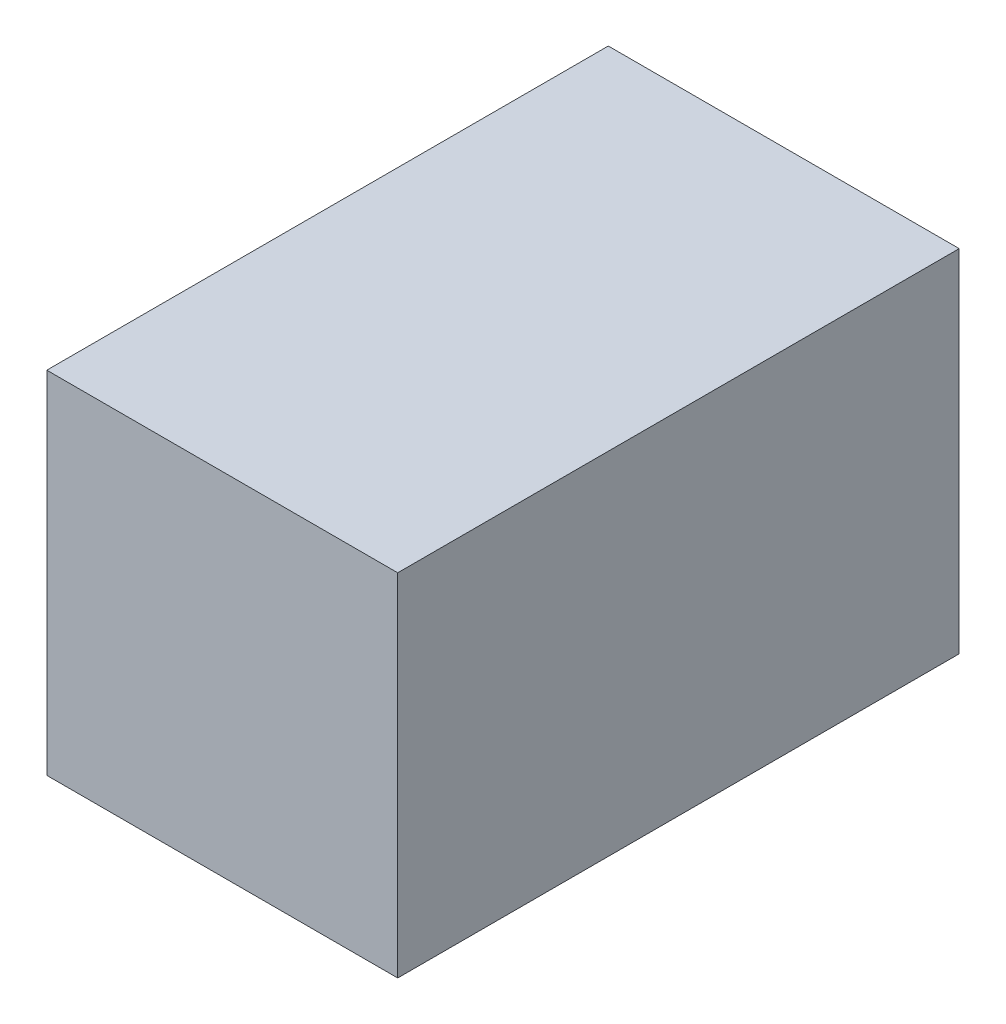
ISO-10303-21;
HEADER;
FILE_DESCRIPTION(('STEP AP214'),'2;1');
FILE_NAME('part.step','',(''),(''),'','','');
FILE_SCHEMA(('AUTOMOTIVE_DESIGN { 1 0 10303 214 1 1 1 1 }'));
ENDSEC;
DATA;
#1=APPLICATION_CONTEXT('core data for automotive mechanical design processes');
#2=APPLICATION_PROTOCOL_DEFINITION('international standard','automotive_design',2000,#1);
#3=PRODUCT_CONTEXT('',#1,'mechanical');
#4=PRODUCT('Part','Part','',(#3));
#5=PRODUCT_RELATED_PRODUCT_CATEGORY('part','',(#4));
#6=PRODUCT_DEFINITION_FORMATION('','',#4);
#7=PRODUCT_DEFINITION_CONTEXT('part definition',#1,'design');
#8=PRODUCT_DEFINITION('design','',#6,#7);
#9=PRODUCT_DEFINITION_SHAPE('','',#8);
#10=(LENGTH_UNIT() NAMED_UNIT(*) SI_UNIT(.MILLI.,.METRE.));
#11=(NAMED_UNIT(*) PLANE_ANGLE_UNIT() SI_UNIT($,.RADIAN.));
#12=(NAMED_UNIT(*) SI_UNIT($,.STERADIAN.) SOLID_ANGLE_UNIT());
#13=UNCERTAINTY_MEASURE_WITH_UNIT(LENGTH_MEASURE(1.E-05),#10,'distance_accuracy_value','');
#14=(GEOMETRIC_REPRESENTATION_CONTEXT(3) GLOBAL_UNCERTAINTY_ASSIGNED_CONTEXT((#13)) GLOBAL_UNIT_ASSIGNED_CONTEXT((#10,
#11,#12)) REPRESENTATION_CONTEXT('',''));
#15=CARTESIAN_POINT('',(0.,0.,0.));
#16=DIRECTION('',(0.,0.,1.));
#17=DIRECTION('',(1.,0.,0.));
#18=AXIS2_PLACEMENT_3D('',#15,#16,#17);
#19=CARTESIAN_POINT('',(0.5,1.,-0.8));
#20=DIRECTION('',(-1.,0.,0.));
#21=DIRECTION('',(0.,0.,1.));
#22=AXIS2_PLACEMENT_3D('',#19,#20,#21);
#23=PLANE('',#22);
#24=DIRECTION('',(0.,0.,-1.));
#25=VECTOR('',#24,1.);
#26=CARTESIAN_POINT('',(0.5,0.,-0.8));
#27=LINE('',#26,#25);
#28=CARTESIAN_POINT('',(0.5,0.,0.8));
#29=VERTEX_POINT('',#28);
#30=CARTESIAN_POINT('',(0.5,0.,-0.8));
#31=VERTEX_POINT('',#30);
#32=EDGE_CURVE('E98',#29,#31,#27,.T.);
#33=ORIENTED_EDGE('',*,*,#32,.T.);
#34=DIRECTION('',(0.,-1.,0.));
#35=VECTOR('',#34,1.);
#36=CARTESIAN_POINT('',(0.5,1.,-0.8));
#37=LINE('',#36,#35);
#38=CARTESIAN_POINT('',(0.5,1.,-0.8));
#39=VERTEX_POINT('',#38);
#40=EDGE_CURVE('E11',#39,#31,#37,.T.);
#41=ORIENTED_EDGE('',*,*,#40,.F.);
#42=DIRECTION('',(0.,0.,-1.));
#43=VECTOR('',#42,1.);
#44=CARTESIAN_POINT('',(0.5,1.,-0.8));
#45=LINE('',#44,#43);
#46=CARTESIAN_POINT('',(0.5,1.,0.8));
#47=VERTEX_POINT('',#46);
#48=EDGE_CURVE('E86',#47,#39,#45,.T.);
#49=ORIENTED_EDGE('',*,*,#48,.F.);
#50=DIRECTION('',(0.,-1.,0.));
#51=VECTOR('',#50,1.);
#52=CARTESIAN_POINT('',(0.5,1.,0.8));
#53=LINE('',#52,#51);
#54=EDGE_CURVE('E94',#47,#29,#53,.T.);
#55=ORIENTED_EDGE('',*,*,#54,.T.);
#56=EDGE_LOOP('',(#33,#41,#49,#55));
#57=FACE_BOUND('',#56,.T.);
#58=ADVANCED_FACE('F35',(#57),#23,.F.);
#59=CARTESIAN_POINT('',(-0.5,1.,-0.8));
#60=DIRECTION('',(0.,0.,1.));
#61=DIRECTION('',(1.,0.,0.));
#62=AXIS2_PLACEMENT_3D('',#59,#60,#61);
#63=PLANE('',#62);
#64=DIRECTION('',(-1.,0.,0.));
#65=VECTOR('',#64,1.);
#66=CARTESIAN_POINT('',(-0.5,0.,-0.8));
#67=LINE('',#66,#65);
#68=CARTESIAN_POINT('',(-0.5,0.,-0.8));
#69=VERTEX_POINT('',#68);
#70=EDGE_CURVE('E90',#31,#69,#67,.T.);
#71=ORIENTED_EDGE('',*,*,#70,.T.);
#72=DIRECTION('',(0.,-1.,0.));
#73=VECTOR('',#72,1.);
#74=CARTESIAN_POINT('',(-0.5,1.,-0.8));
#75=LINE('',#74,#73);
#76=CARTESIAN_POINT('',(-0.5,1.,-0.8));
#77=VERTEX_POINT('',#76);
#78=EDGE_CURVE('E43',#77,#69,#75,.T.);
#79=ORIENTED_EDGE('',*,*,#78,.F.);
#80=DIRECTION('',(-1.,0.,0.));
#81=VECTOR('',#80,1.);
#82=CARTESIAN_POINT('',(-0.5,1.,-0.8));
#83=LINE('',#82,#81);
#84=EDGE_CURVE('E81',#39,#77,#83,.T.);
#85=ORIENTED_EDGE('',*,*,#84,.F.);
#86=ORIENTED_EDGE('',*,*,#40,.T.);
#87=EDGE_LOOP('',(#71,#79,#85,#86));
#88=FACE_BOUND('',#87,.T.);
#89=ADVANCED_FACE('F89',(#88),#63,.F.);
#90=CARTESIAN_POINT('',(-0.5,1.,-0.8));
#91=DIRECTION('',(1.,0.,0.));
#92=DIRECTION('',(0.,0.,-1.));
#93=AXIS2_PLACEMENT_3D('',#90,#91,#92);
#94=PLANE('',#93);
#95=DIRECTION('',(0.,0.,1.));
#96=VECTOR('',#95,1.);
#97=CARTESIAN_POINT('',(-0.5,0.,-0.8));
#98=LINE('',#97,#96);
#99=CARTESIAN_POINT('',(-0.5,0.,0.8));
#100=VERTEX_POINT('',#99);
#101=EDGE_CURVE('E68',#69,#100,#98,.T.);
#102=ORIENTED_EDGE('',*,*,#101,.T.);
#103=DIRECTION('',(0.,-1.,0.));
#104=VECTOR('',#103,1.);
#105=CARTESIAN_POINT('',(-0.5,1.,0.8));
#106=LINE('',#105,#104);
#107=CARTESIAN_POINT('',(-0.5,1.,0.8));
#108=VERTEX_POINT('',#107);
#109=EDGE_CURVE('E91',#108,#100,#106,.T.);
#110=ORIENTED_EDGE('',*,*,#109,.F.);
#111=DIRECTION('',(0.,0.,1.));
#112=VECTOR('',#111,1.);
#113=CARTESIAN_POINT('',(-0.5,1.,-0.8));
#114=LINE('',#113,#112);
#115=EDGE_CURVE('E84',#77,#108,#114,.T.);
#116=ORIENTED_EDGE('',*,*,#115,.F.);
#117=ORIENTED_EDGE('',*,*,#78,.T.);
#118=EDGE_LOOP('',(#102,#110,#116,#117));
#119=FACE_BOUND('',#118,.T.);
#120=ADVANCED_FACE('F92',(#119),#94,.F.);
#121=CARTESIAN_POINT('',(-0.5,1.,0.8));
#122=DIRECTION('',(0.,0.,-1.));
#123=DIRECTION('',(-1.,0.,0.));
#124=AXIS2_PLACEMENT_3D('',#121,#122,#123);
#125=PLANE('',#124);
#126=DIRECTION('',(1.,0.,0.));
#127=VECTOR('',#126,1.);
#128=CARTESIAN_POINT('',(-0.5,0.,0.8));
#129=LINE('',#128,#127);
#130=EDGE_CURVE('E74',#100,#29,#129,.T.);
#131=ORIENTED_EDGE('',*,*,#130,.T.);
#132=ORIENTED_EDGE('',*,*,#54,.F.);
#133=DIRECTION('',(1.,0.,0.));
#134=VECTOR('',#133,1.);
#135=CARTESIAN_POINT('',(-0.5,1.,0.8));
#136=LINE('',#135,#134);
#137=EDGE_CURVE('E51',#108,#47,#136,.T.);
#138=ORIENTED_EDGE('',*,*,#137,.F.);
#139=ORIENTED_EDGE('',*,*,#109,.T.);
#140=EDGE_LOOP('',(#131,#132,#138,#139));
#141=FACE_BOUND('',#140,.T.);
#142=ADVANCED_FACE('F105',(#141),#125,.F.);
#143=CARTESIAN_POINT('',(0.,1.,0.));
#144=DIRECTION('',(0.,1.,0.));
#145=DIRECTION('',(0.,0.,1.));
#146=AXIS2_PLACEMENT_3D('',#143,#144,#145);
#147=PLANE('',#146);
#148=ORIENTED_EDGE('',*,*,#48,.T.);
#149=ORIENTED_EDGE('',*,*,#84,.T.);
#150=ORIENTED_EDGE('',*,*,#115,.T.);
#151=ORIENTED_EDGE('',*,*,#137,.T.);
#152=EDGE_LOOP('',(#148,#149,#150,#151));
#153=FACE_BOUND('',#152,.T.);
#154=ADVANCED_FACE('F82',(#153),#147,.T.);
#155=CARTESIAN_POINT('',(0.,0.,0.));
#156=DIRECTION('',(0.,1.,0.));
#157=DIRECTION('',(0.,0.,1.));
#158=AXIS2_PLACEMENT_3D('',#155,#156,#157);
#159=PLANE('',#158);
#160=ORIENTED_EDGE('',*,*,#32,.F.);
#161=ORIENTED_EDGE('',*,*,#130,.F.);
#162=ORIENTED_EDGE('',*,*,#101,.F.);
#163=ORIENTED_EDGE('',*,*,#70,.F.);
#164=EDGE_LOOP('',(#160,#161,#162,#163));
#165=FACE_BOUND('',#164,.T.);
#166=ADVANCED_FACE('F108',(#165),#159,.F.);
#167=CLOSED_SHELL('',(#58,#89,#120,#142,#154,#166));
#168=MANIFOLD_SOLID_BREP('B2',#167);
#169=ADVANCED_BREP_SHAPE_REPRESENTATION('',(#18,#168),#14);
#170=SHAPE_DEFINITION_REPRESENTATION(#9,#169);
ENDSEC;
END-ISO-10303-21;
